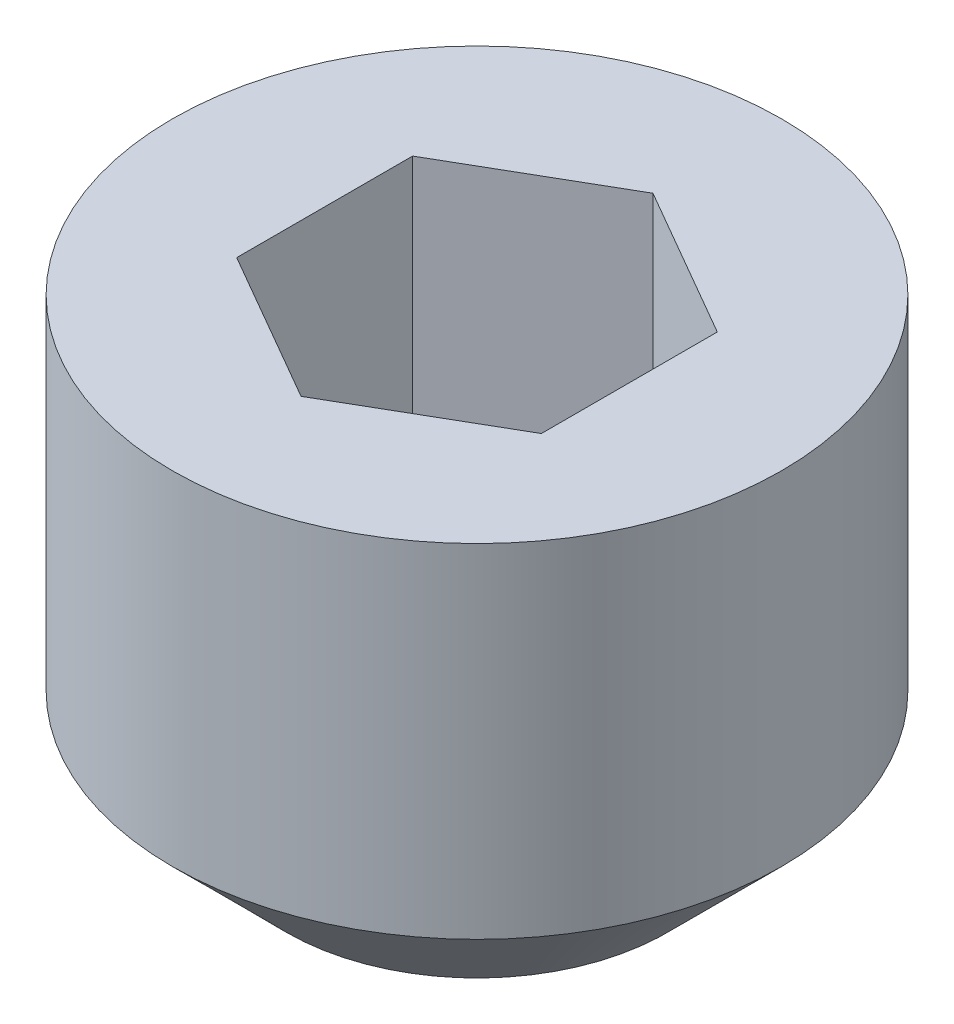
ISO-10303-21;
HEADER;
FILE_DESCRIPTION(('STEP AP214'),'2;1');
FILE_NAME('part.step','',(''),(''),'','','');
FILE_SCHEMA(('AUTOMOTIVE_DESIGN { 1 0 10303 214 1 1 1 1 }'));
ENDSEC;
DATA;
#1=APPLICATION_CONTEXT('core data for automotive mechanical design processes');
#2=APPLICATION_PROTOCOL_DEFINITION('international standard','automotive_design',2000,#1);
#3=PRODUCT_CONTEXT('',#1,'mechanical');
#4=PRODUCT('Part','Part','',(#3));
#5=PRODUCT_RELATED_PRODUCT_CATEGORY('part','',(#4));
#6=PRODUCT_DEFINITION_FORMATION('','',#4);
#7=PRODUCT_DEFINITION_CONTEXT('part definition',#1,'design');
#8=PRODUCT_DEFINITION('design','',#6,#7);
#9=PRODUCT_DEFINITION_SHAPE('','',#8);
#10=(LENGTH_UNIT() NAMED_UNIT(*) SI_UNIT(.MILLI.,.METRE.));
#11=(NAMED_UNIT(*) PLANE_ANGLE_UNIT() SI_UNIT($,.RADIAN.));
#12=(NAMED_UNIT(*) SI_UNIT($,.STERADIAN.) SOLID_ANGLE_UNIT());
#13=UNCERTAINTY_MEASURE_WITH_UNIT(LENGTH_MEASURE(1.E-05),#10,'distance_accuracy_value','');
#14=(GEOMETRIC_REPRESENTATION_CONTEXT(3) GLOBAL_UNCERTAINTY_ASSIGNED_CONTEXT((#13)) GLOBAL_UNIT_ASSIGNED_CONTEXT((#10,
#11,#12)) REPRESENTATION_CONTEXT('',''));
#15=CARTESIAN_POINT('',(0.,0.,0.));
#16=DIRECTION('',(0.,0.,1.));
#17=DIRECTION('',(1.,0.,0.));
#18=AXIS2_PLACEMENT_3D('',#15,#16,#17);
#19=CARTESIAN_POINT('',(0.,3.,0.));
#20=DIRECTION('',(0.,-1.,0.));
#21=DIRECTION('',(1.,0.,0.));
#22=AXIS2_PLACEMENT_3D('',#19,#20,#21);
#23=PLANE('',#22);
#24=CARTESIAN_POINT('',(0.,3.,0.));
#25=DIRECTION('',(0.,1.,0.));
#26=DIRECTION('',(-1.,0.,0.));
#27=AXIS2_PLACEMENT_3D('',#24,#25,#26);
#28=CIRCLE('',#27,2.);
#29=CARTESIAN_POINT('',(-2.,3.,0.));
#30=VERTEX_POINT('',#29);
#31=EDGE_CURVE('E11',#30,#30,#28,.T.);
#32=ORIENTED_EDGE('',*,*,#31,.T.);
#33=EDGE_LOOP('',(#32));
#34=FACE_BOUND('',#33,.T.);
#35=DIRECTION('',(-0.866025403784439,0.,0.5));
#36=VECTOR('',#35,1.);
#37=CARTESIAN_POINT('',(0.,3.,-1.15470053837925));
#38=LINE('',#37,#36);
#39=CARTESIAN_POINT('',(0.,3.,-1.15470053837925));
#40=VERTEX_POINT('',#39);
#41=CARTESIAN_POINT('',(-0.999999999999998,3.,-0.577350269189626));
#42=VERTEX_POINT('',#41);
#43=EDGE_CURVE('E150',#40,#42,#38,.T.);
#44=ORIENTED_EDGE('',*,*,#43,.F.);
#45=DIRECTION('',(-0.866025403784439,0.,-0.5));
#46=VECTOR('',#45,1.);
#47=CARTESIAN_POINT('',(0.999999999999999,3.,-0.577350269189626));
#48=LINE('',#47,#46);
#49=CARTESIAN_POINT('',(0.999999999999999,3.,-0.577350269189626));
#50=VERTEX_POINT('',#49);
#51=EDGE_CURVE('E50',#50,#40,#48,.T.);
#52=ORIENTED_EDGE('',*,*,#51,.F.);
#53=DIRECTION('',(0.,0.,-1.));
#54=VECTOR('',#53,1.);
#55=CARTESIAN_POINT('',(1.,3.,0.577350269189626));
#56=LINE('',#55,#54);
#57=CARTESIAN_POINT('',(1.,3.,0.577350269189626));
#58=VERTEX_POINT('',#57);
#59=EDGE_CURVE('E120',#58,#50,#56,.T.);
#60=ORIENTED_EDGE('',*,*,#59,.F.);
#61=DIRECTION('',(0.866025403784439,0.,-0.5));
#62=VECTOR('',#61,1.);
#63=CARTESIAN_POINT('',(0.,3.,1.15470053837925));
#64=LINE('',#63,#62);
#65=CARTESIAN_POINT('',(0.,3.,1.15470053837925));
#66=VERTEX_POINT('',#65);
#67=EDGE_CURVE('E158',#66,#58,#64,.T.);
#68=ORIENTED_EDGE('',*,*,#67,.F.);
#69=DIRECTION('',(0.866025403784439,0.,0.5));
#70=VECTOR('',#69,1.);
#71=CARTESIAN_POINT('',(-0.999999999999998,3.,0.577350269189626));
#72=LINE('',#71,#70);
#73=CARTESIAN_POINT('',(-0.999999999999998,3.,0.577350269189626));
#74=VERTEX_POINT('',#73);
#75=EDGE_CURVE('E155',#74,#66,#72,.T.);
#76=ORIENTED_EDGE('',*,*,#75,.F.);
#77=DIRECTION('',(0.,0.,1.));
#78=VECTOR('',#77,1.);
#79=CARTESIAN_POINT('',(-0.999999999999998,3.,-0.577350269189626));
#80=LINE('',#79,#78);
#81=EDGE_CURVE('E153',#42,#74,#80,.T.);
#82=ORIENTED_EDGE('',*,*,#81,.F.);
#83=EDGE_LOOP('',(#44,#52,#60,#68,#76,#82));
#84=FACE_BOUND('',#83,.T.);
#85=ADVANCED_FACE('F36',(#34,#84),#23,.F.);
#86=CARTESIAN_POINT('',(0.,3.,0.));
#87=DIRECTION('',(0.,1.,0.));
#88=DIRECTION('',(-1.,0.,0.));
#89=AXIS2_PLACEMENT_3D('',#86,#87,#88);
#90=CYLINDRICAL_SURFACE('',#89,2.);
#91=CARTESIAN_POINT('',(0.,0.749999999999992,0.));
#92=DIRECTION('',(0.,-1.,0.));
#93=DIRECTION('',(0.,0.,-1.));
#94=AXIS2_PLACEMENT_3D('',#91,#92,#93);
#95=CIRCLE('',#94,2.);
#96=CARTESIAN_POINT('',(0.,0.749999999999992,-2.));
#97=VERTEX_POINT('',#96);
#98=EDGE_CURVE('E359',#97,#97,#95,.T.);
#99=ORIENTED_EDGE('',*,*,#98,.F.);
#100=EDGE_LOOP('',(#99));
#101=FACE_BOUND('',#100,.T.);
#102=ORIENTED_EDGE('',*,*,#31,.F.);
#103=EDGE_LOOP('',(#102));
#104=FACE_BOUND('',#103,.T.);
#105=ADVANCED_FACE('F219',(#101,#104),#90,.T.);
#106=CARTESIAN_POINT('',(0.999999999999999,1.5,-0.577350269189626));
#107=DIRECTION('',(0.5,0.,-0.866025403784439));
#108=DIRECTION('',(-0.866025403784439,0.,-0.5));
#109=AXIS2_PLACEMENT_3D('',#106,#107,#108);
#110=PLANE('',#109);
#111=DIRECTION('',(-0.866025403784439,0.,-0.5));
#112=VECTOR('',#111,1.);
#113=CARTESIAN_POINT('',(0.999999999999999,1.5,-0.577350269189626));
#114=LINE('',#113,#112);
#115=CARTESIAN_POINT('',(0.999999999999999,1.5,-0.577350269189626));
#116=VERTEX_POINT('',#115);
#117=CARTESIAN_POINT('',(0.5,1.5,-0.866025403784438));
#118=VERTEX_POINT('',#117);
#119=EDGE_CURVE('E119',#116,#118,#114,.T.);
#120=ORIENTED_EDGE('',*,*,#119,.F.);
#121=DIRECTION('',(0.,1.,0.));
#122=VECTOR('',#121,1.);
#123=CARTESIAN_POINT('',(0.999999999999999,1.5,-0.577350269189626));
#124=LINE('',#123,#122);
#125=EDGE_CURVE('E161',#116,#50,#124,.T.);
#126=ORIENTED_EDGE('',*,*,#125,.T.);
#127=ORIENTED_EDGE('',*,*,#51,.T.);
#128=DIRECTION('',(0.,1.,0.));
#129=VECTOR('',#128,1.);
#130=CARTESIAN_POINT('',(0.,1.5,-1.15470053837925));
#131=LINE('',#130,#129);
#132=CARTESIAN_POINT('',(0.,1.5,-1.15470053837925));
#133=VERTEX_POINT('',#132);
#134=EDGE_CURVE('E122',#133,#40,#131,.T.);
#135=ORIENTED_EDGE('',*,*,#134,.F.);
#136=EDGE_CURVE('E111',#118,#133,#114,.T.);
#137=ORIENTED_EDGE('',*,*,#136,.F.);
#138=EDGE_LOOP('',(#120,#126,#127,#135,#137));
#139=FACE_BOUND('',#138,.T.);
#140=ADVANCED_FACE('F123',(#139),#110,.F.);
#141=CARTESIAN_POINT('',(0.999999999999999,1.5,0.577350269189626));
#142=DIRECTION('',(1.,0.,0.));
#143=DIRECTION('',(0.,0.,-1.));
#144=AXIS2_PLACEMENT_3D('',#141,#142,#143);
#145=PLANE('',#144);
#146=DIRECTION('',(0.,0.,-1.));
#147=VECTOR('',#146,1.);
#148=CARTESIAN_POINT('',(0.999999999999999,1.5,0.577350269189626));
#149=LINE('',#148,#147);
#150=CARTESIAN_POINT('',(0.999999999999999,1.5,0.577350269189626));
#151=VERTEX_POINT('',#150);
#152=CARTESIAN_POINT('',(0.999999999999999,1.5,0.));
#153=VERTEX_POINT('',#152);
#154=EDGE_CURVE('E127',#151,#153,#149,.T.);
#155=ORIENTED_EDGE('',*,*,#154,.F.);
#156=DIRECTION('',(0.,1.,0.));
#157=VECTOR('',#156,1.);
#158=CARTESIAN_POINT('',(0.999999999999999,1.5,0.577350269189626));
#159=LINE('',#158,#157);
#160=EDGE_CURVE('E164',#151,#58,#159,.T.);
#161=ORIENTED_EDGE('',*,*,#160,.T.);
#162=ORIENTED_EDGE('',*,*,#59,.T.);
#163=ORIENTED_EDGE('',*,*,#125,.F.);
#164=EDGE_CURVE('E146',#153,#116,#149,.T.);
#165=ORIENTED_EDGE('',*,*,#164,.F.);
#166=EDGE_LOOP('',(#155,#161,#162,#163,#165));
#167=FACE_BOUND('',#166,.T.);
#168=ADVANCED_FACE('F192',(#167),#145,.F.);
#169=CARTESIAN_POINT('',(0.,1.5,1.15470053837925));
#170=DIRECTION('',(0.5,0.,0.866025403784439));
#171=DIRECTION('',(0.866025403784439,0.,-0.5));
#172=AXIS2_PLACEMENT_3D('',#169,#170,#171);
#173=PLANE('',#172);
#174=DIRECTION('',(0.866025403784439,0.,-0.5));
#175=VECTOR('',#174,1.);
#176=CARTESIAN_POINT('',(0.,1.5,1.15470053837925));
#177=LINE('',#176,#175);
#178=CARTESIAN_POINT('',(0.,1.5,1.15470053837925));
#179=VERTEX_POINT('',#178);
#180=CARTESIAN_POINT('',(0.5,1.5,0.866025403784438));
#181=VERTEX_POINT('',#180);
#182=EDGE_CURVE('E58',#179,#181,#177,.T.);
#183=ORIENTED_EDGE('',*,*,#182,.F.);
#184=DIRECTION('',(0.,1.,0.));
#185=VECTOR('',#184,1.);
#186=CARTESIAN_POINT('',(0.,1.5,1.15470053837925));
#187=LINE('',#186,#185);
#188=EDGE_CURVE('E167',#179,#66,#187,.T.);
#189=ORIENTED_EDGE('',*,*,#188,.T.);
#190=ORIENTED_EDGE('',*,*,#67,.T.);
#191=ORIENTED_EDGE('',*,*,#160,.F.);
#192=EDGE_CURVE('E144',#181,#151,#177,.T.);
#193=ORIENTED_EDGE('',*,*,#192,.F.);
#194=EDGE_LOOP('',(#183,#189,#190,#191,#193));
#195=FACE_BOUND('',#194,.T.);
#196=ADVANCED_FACE('F247',(#195),#173,.F.);
#197=CARTESIAN_POINT('',(-0.999999999999999,1.5,0.577350269189626));
#198=DIRECTION('',(-0.5,0.,0.866025403784438));
#199=DIRECTION('',(0.866025403784439,0.,0.5));
#200=AXIS2_PLACEMENT_3D('',#197,#198,#199);
#201=PLANE('',#200);
#202=DIRECTION('',(0.866025403784439,0.,0.5));
#203=VECTOR('',#202,1.);
#204=CARTESIAN_POINT('',(-0.999999999999999,1.5,0.577350269189626));
#205=LINE('',#204,#203);
#206=CARTESIAN_POINT('',(-0.999999999999999,1.5,0.577350269189626));
#207=VERTEX_POINT('',#206);
#208=CARTESIAN_POINT('',(-0.499999999999999,1.5,0.866025403784438));
#209=VERTEX_POINT('',#208);
#210=EDGE_CURVE('E141',#207,#209,#205,.T.);
#211=ORIENTED_EDGE('',*,*,#210,.F.);
#212=DIRECTION('',(0.,1.,0.));
#213=VECTOR('',#212,1.);
#214=CARTESIAN_POINT('',(-0.999999999999999,1.5,0.577350269189626));
#215=LINE('',#214,#213);
#216=EDGE_CURVE('E170',#207,#74,#215,.T.);
#217=ORIENTED_EDGE('',*,*,#216,.T.);
#218=ORIENTED_EDGE('',*,*,#75,.T.);
#219=ORIENTED_EDGE('',*,*,#188,.F.);
#220=EDGE_CURVE('E140',#209,#179,#205,.T.);
#221=ORIENTED_EDGE('',*,*,#220,.F.);
#222=EDGE_LOOP('',(#211,#217,#218,#219,#221));
#223=FACE_BOUND('',#222,.T.);
#224=ADVANCED_FACE('F244',(#223),#201,.F.);
#225=CARTESIAN_POINT('',(-0.999999999999999,1.5,-0.577350269189626));
#226=DIRECTION('',(-1.,0.,0.));
#227=DIRECTION('',(0.,-1.,0.));
#228=AXIS2_PLACEMENT_3D('',#225,#226,#227);
#229=PLANE('',#228);
#230=DIRECTION('',(0.,0.,1.));
#231=VECTOR('',#230,1.);
#232=CARTESIAN_POINT('',(-0.999999999999999,1.5,-0.577350269189626));
#233=LINE('',#232,#231);
#234=CARTESIAN_POINT('',(-0.999999999999999,1.5,-0.577350269189626));
#235=VERTEX_POINT('',#234);
#236=CARTESIAN_POINT('',(-0.999999999999999,1.5,0.));
#237=VERTEX_POINT('',#236);
#238=EDGE_CURVE('E135',#235,#237,#233,.T.);
#239=ORIENTED_EDGE('',*,*,#238,.F.);
#240=DIRECTION('',(0.,1.,0.));
#241=VECTOR('',#240,1.);
#242=CARTESIAN_POINT('',(-0.999999999999999,1.5,-0.577350269189626));
#243=LINE('',#242,#241);
#244=EDGE_CURVE('E126',#235,#42,#243,.T.);
#245=ORIENTED_EDGE('',*,*,#244,.T.);
#246=ORIENTED_EDGE('',*,*,#81,.T.);
#247=ORIENTED_EDGE('',*,*,#216,.F.);
#248=EDGE_CURVE('E133',#237,#207,#233,.T.);
#249=ORIENTED_EDGE('',*,*,#248,.F.);
#250=EDGE_LOOP('',(#239,#245,#246,#247,#249));
#251=FACE_BOUND('',#250,.T.);
#252=ADVANCED_FACE('F202',(#251),#229,.F.);
#253=CARTESIAN_POINT('',(0.,1.5,-1.15470053837925));
#254=DIRECTION('',(-0.5,0.,-0.866025403784438));
#255=DIRECTION('',(-0.866025403784439,0.,0.5));
#256=AXIS2_PLACEMENT_3D('',#253,#254,#255);
#257=PLANE('',#256);
#258=DIRECTION('',(-0.866025403784439,0.,0.5));
#259=VECTOR('',#258,1.);
#260=CARTESIAN_POINT('',(0.,1.5,-1.15470053837925));
#261=LINE('',#260,#259);
#262=CARTESIAN_POINT('',(-0.499999999999999,1.5,-0.866025403784438));
#263=VERTEX_POINT('',#262);
#264=EDGE_CURVE('E114',#133,#263,#261,.T.);
#265=ORIENTED_EDGE('',*,*,#264,.F.);
#266=ORIENTED_EDGE('',*,*,#134,.T.);
#267=ORIENTED_EDGE('',*,*,#43,.T.);
#268=ORIENTED_EDGE('',*,*,#244,.F.);
#269=EDGE_CURVE('E132',#263,#235,#261,.T.);
#270=ORIENTED_EDGE('',*,*,#269,.F.);
#271=EDGE_LOOP('',(#265,#266,#267,#268,#270));
#272=FACE_BOUND('',#271,.T.);
#273=ADVANCED_FACE('F130',(#272),#257,.F.);
#274=CARTESIAN_POINT('',(0.,1.5,0.));
#275=DIRECTION('',(0.,1.,0.));
#276=DIRECTION('',(0.,0.,1.));
#277=AXIS2_PLACEMENT_3D('',#274,#275,#276);
#278=PLANE('',#277);
#279=ORIENTED_EDGE('',*,*,#192,.T.);
#280=ORIENTED_EDGE('',*,*,#154,.T.);
#281=CARTESIAN_POINT('',(0.,1.5,0.));
#282=DIRECTION('',(0.,1.,0.));
#283=DIRECTION('',(-1.,0.,0.));
#284=AXIS2_PLACEMENT_3D('',#281,#282,#283);
#285=CIRCLE('',#284,0.999999999999999);
#286=EDGE_CURVE('E179',#181,#153,#285,.T.);
#287=ORIENTED_EDGE('',*,*,#286,.F.);
#288=EDGE_LOOP('',(#279,#280,#287));
#289=FACE_BOUND('',#288,.T.);
#290=ADVANCED_FACE('F187',(#289),#278,.T.);
#291=ORIENTED_EDGE('',*,*,#164,.T.);
#292=ORIENTED_EDGE('',*,*,#119,.T.);
#293=EDGE_CURVE('E180',#153,#118,#285,.T.);
#294=ORIENTED_EDGE('',*,*,#293,.F.);
#295=EDGE_LOOP('',(#291,#292,#294));
#296=FACE_BOUND('',#295,.T.);
#297=ADVANCED_FACE('F196',(#296),#278,.T.);
#298=ORIENTED_EDGE('',*,*,#136,.T.);
#299=ORIENTED_EDGE('',*,*,#264,.T.);
#300=EDGE_CURVE('E116',#118,#263,#285,.T.);
#301=ORIENTED_EDGE('',*,*,#300,.F.);
#302=EDGE_LOOP('',(#298,#299,#301));
#303=FACE_BOUND('',#302,.T.);
#304=ADVANCED_FACE('F112',(#303),#278,.T.);
#305=ORIENTED_EDGE('',*,*,#269,.T.);
#306=ORIENTED_EDGE('',*,*,#238,.T.);
#307=EDGE_CURVE('E163',#263,#237,#285,.T.);
#308=ORIENTED_EDGE('',*,*,#307,.F.);
#309=EDGE_LOOP('',(#305,#306,#308));
#310=FACE_BOUND('',#309,.T.);
#311=ADVANCED_FACE('F206',(#310),#278,.T.);
#312=ORIENTED_EDGE('',*,*,#248,.T.);
#313=ORIENTED_EDGE('',*,*,#210,.T.);
#314=EDGE_CURVE('E43',#237,#209,#285,.T.);
#315=ORIENTED_EDGE('',*,*,#314,.F.);
#316=EDGE_LOOP('',(#312,#313,#315));
#317=FACE_BOUND('',#316,.T.);
#318=ADVANCED_FACE('F208',(#317),#278,.T.);
#319=ORIENTED_EDGE('',*,*,#220,.T.);
#320=ORIENTED_EDGE('',*,*,#182,.T.);
#321=EDGE_CURVE('E175',#209,#181,#285,.T.);
#322=ORIENTED_EDGE('',*,*,#321,.F.);
#323=EDGE_LOOP('',(#319,#320,#322));
#324=FACE_BOUND('',#323,.T.);
#325=ADVANCED_FACE('F214',(#324),#278,.T.);
#326=CARTESIAN_POINT('',(0.,0.922649730810378,0.));
#327=DIRECTION('',(0.,1.,0.));
#328=DIRECTION('',(-1.,0.,0.));
#329=AXIS2_PLACEMENT_3D('',#326,#327,#328);
#330=CONICAL_SURFACE('',#329,0.,1.0471975511966);
#331=ORIENTED_EDGE('',*,*,#314,.T.);
#332=ORIENTED_EDGE('',*,*,#321,.T.);
#333=ORIENTED_EDGE('',*,*,#286,.T.);
#334=ORIENTED_EDGE('',*,*,#293,.T.);
#335=ORIENTED_EDGE('',*,*,#300,.T.);
#336=ORIENTED_EDGE('',*,*,#307,.T.);
#337=EDGE_LOOP('',(#331,#332,#333,#334,#335,#336));
#338=FACE_BOUND('',#337,.T.);
#339=CARTESIAN_POINT('',(0.,0.922649730810378,0.));
#340=VERTEX_POINT('',#339);
#341=VERTEX_LOOP('',#340);
#342=FACE_BOUND('',#341,.T.);
#343=ADVANCED_FACE('F184',(#338,#342),#330,.F.);
#344=CARTESIAN_POINT('',(0.,0.749999999999992,0.));
#345=DIRECTION('',(0.,1.,0.));
#346=DIRECTION('',(0.,0.,1.));
#347=AXIS2_PLACEMENT_3D('',#344,#345,#346);
#348=CONICAL_SURFACE('',#347,2.,0.785398163397453);
#349=CARTESIAN_POINT('',(0.,0.,0.));
#350=DIRECTION('',(0.,-1.,0.));
#351=DIRECTION('',(0.,0.,-1.));
#352=AXIS2_PLACEMENT_3D('',#349,#350,#351);
#353=CIRCLE('',#352,1.25);
#354=CARTESIAN_POINT('',(0.,0.,-1.25));
#355=VERTEX_POINT('',#354);
#356=EDGE_CURVE('E151',#355,#355,#353,.T.);
#357=ORIENTED_EDGE('',*,*,#356,.F.);
#358=EDGE_LOOP('',(#357));
#359=FACE_BOUND('',#358,.T.);
#360=ORIENTED_EDGE('',*,*,#98,.T.);
#361=EDGE_LOOP('',(#360));
#362=FACE_BOUND('',#361,.T.);
#363=ADVANCED_FACE('F236',(#359,#362),#348,.T.);
#364=CARTESIAN_POINT('',(2.,0.,0.));
#365=DIRECTION('',(0.,1.,0.));
#366=DIRECTION('',(-1.,0.,0.));
#367=AXIS2_PLACEMENT_3D('',#364,#365,#366);
#368=PLANE('',#367);
#369=ORIENTED_EDGE('',*,*,#356,.T.);
#370=EDGE_LOOP('',(#369));
#371=FACE_BOUND('',#370,.T.);
#372=ADVANCED_FACE('F233',(#371),#368,.F.);
#373=CLOSED_SHELL('',(#85,#105,#140,#168,#196,#224,#252,#273,#290,#297,#304,#311,#318,#325,#343,
#363,#372));
#374=MANIFOLD_SOLID_BREP('B2',#373);
#375=ADVANCED_BREP_SHAPE_REPRESENTATION('',(#18,#374),#14);
#376=SHAPE_DEFINITION_REPRESENTATION(#9,#375);
ENDSEC;
END-ISO-10303-21;
